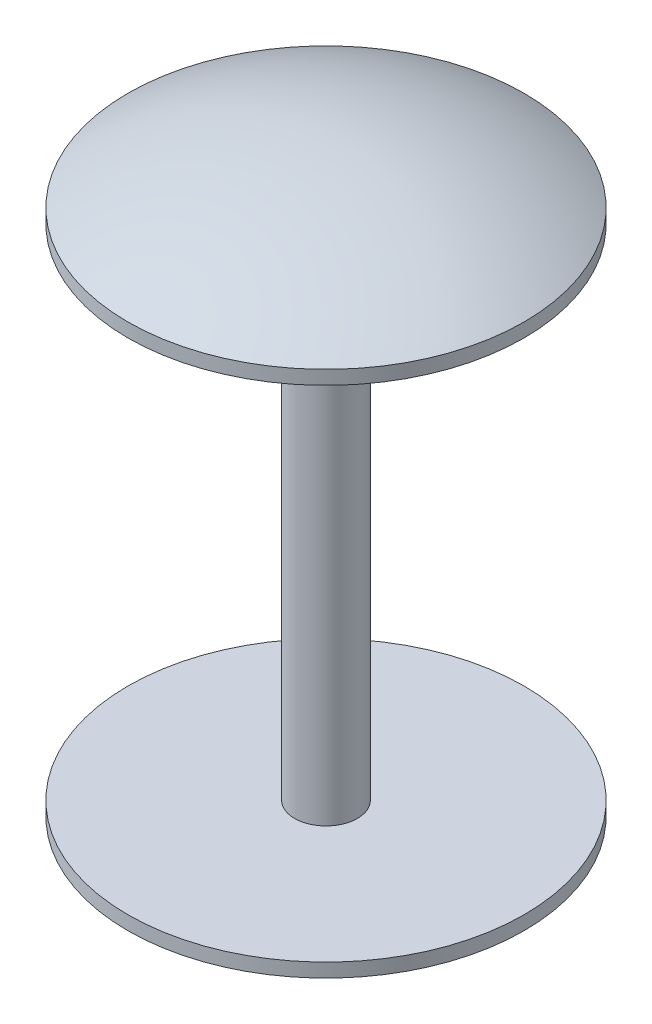
ISO-10303-21;
HEADER;
FILE_DESCRIPTION(('STEP AP214'),'2;1');
FILE_NAME('part.step','',(''),(''),'','','');
FILE_SCHEMA(('AUTOMOTIVE_DESIGN { 1 0 10303 214 1 1 1 1 }'));
ENDSEC;
DATA;
#1=APPLICATION_CONTEXT('core data for automotive mechanical design processes');
#2=APPLICATION_PROTOCOL_DEFINITION('international standard','automotive_design',2000,#1);
#3=PRODUCT_CONTEXT('',#1,'mechanical');
#4=PRODUCT('Part','Part','',(#3));
#5=PRODUCT_RELATED_PRODUCT_CATEGORY('part','',(#4));
#6=PRODUCT_DEFINITION_FORMATION('','',#4);
#7=PRODUCT_DEFINITION_CONTEXT('part definition',#1,'design');
#8=PRODUCT_DEFINITION('design','',#6,#7);
#9=PRODUCT_DEFINITION_SHAPE('','',#8);
#10=(LENGTH_UNIT() NAMED_UNIT(*) SI_UNIT(.MILLI.,.METRE.));
#11=(NAMED_UNIT(*) PLANE_ANGLE_UNIT() SI_UNIT($,.RADIAN.));
#12=(NAMED_UNIT(*) SI_UNIT($,.STERADIAN.) SOLID_ANGLE_UNIT());
#13=UNCERTAINTY_MEASURE_WITH_UNIT(LENGTH_MEASURE(1.E-05),#10,'distance_accuracy_value','');
#14=(GEOMETRIC_REPRESENTATION_CONTEXT(3) GLOBAL_UNCERTAINTY_ASSIGNED_CONTEXT((#13)) GLOBAL_UNIT_ASSIGNED_CONTEXT((#10,
#11,#12)) REPRESENTATION_CONTEXT('',''));
#15=CARTESIAN_POINT('',(0.,0.,0.));
#16=DIRECTION('',(0.,0.,1.));
#17=DIRECTION('',(1.,0.,0.));
#18=AXIS2_PLACEMENT_3D('',#15,#16,#17);
#19=CARTESIAN_POINT('',(0.,19.,0.));
#20=DIRECTION('',(0.,-1.,0.));
#21=DIRECTION('',(0.,0.,-1.));
#22=AXIS2_PLACEMENT_3D('',#19,#20,#21);
#23=CYLINDRICAL_SURFACE('',#22,14.2786773106514);
#24=CARTESIAN_POINT('',(0.,-19.,0.));
#25=DIRECTION('',(0.,1.,0.));
#26=DIRECTION('',(0.,0.,1.));
#27=AXIS2_PLACEMENT_3D('',#24,#25,#26);
#28=CIRCLE('',#27,14.2786773106514);
#29=CARTESIAN_POINT('',(0.,-19.,14.2786773106514));
#30=VERTEX_POINT('',#29);
#31=EDGE_CURVE('E42',#30,#30,#28,.T.);
#32=ORIENTED_EDGE('',*,*,#31,.T.);
#33=EDGE_LOOP('',(#32));
#34=FACE_BOUND('',#33,.T.);
#35=CARTESIAN_POINT('',(0.,-18.,0.));
#36=DIRECTION('',(0.,1.,0.));
#37=DIRECTION('',(0.,0.,1.));
#38=AXIS2_PLACEMENT_3D('',#35,#36,#37);
#39=CIRCLE('',#38,14.2786773106514);
#40=CARTESIAN_POINT('',(0.,-18.,14.2786773106514));
#41=VERTEX_POINT('',#40);
#42=EDGE_CURVE('E46',#41,#41,#39,.T.);
#43=ORIENTED_EDGE('',*,*,#42,.F.);
#44=EDGE_LOOP('',(#43));
#45=FACE_BOUND('',#44,.T.);
#46=ADVANCED_FACE('F35',(#34,#45),#23,.T.);
#47=CARTESIAN_POINT('',(0.,4.485078217714,0.));
#48=DIRECTION('',(0.,0.,1.));
#49=DIRECTION('',(1.,0.,0.));
#50=AXIS2_PLACEMENT_3D('',#47,#48,#49);
#51=SPHERICAL_SURFACE('',#50,27.485078217714);
#52=CARTESIAN_POINT('',(0.,4.485078217714,0.));
#53=DIRECTION('',(0.,1.,0.));
#54=DIRECTION('',(0.,0.,1.));
#55=AXIS2_PLACEMENT_3D('',#52,#53,#54);
#56=SPHERICAL_SURFACE('',#55,27.485078217714);
#57=ORIENTED_EDGE('',*,*,#31,.F.);
#58=EDGE_LOOP('',(#57));
#59=FACE_BOUND('',#58,.T.);
#60=ADVANCED_FACE('F73',(#59),#56,.T.);
#61=CARTESIAN_POINT('',(0.,-18.,0.));
#62=DIRECTION('',(0.,1.,0.));
#63=DIRECTION('',(0.,0.,1.));
#64=AXIS2_PLACEMENT_3D('',#61,#62,#63);
#65=CYLINDRICAL_SURFACE('',#64,2.26163251067104);
#66=CARTESIAN_POINT('',(0.,-18.,0.));
#67=DIRECTION('',(0.,1.,0.));
#68=DIRECTION('',(0.,0.,1.));
#69=AXIS2_PLACEMENT_3D('',#66,#67,#68);
#70=CIRCLE('',#69,2.26163251067104);
#71=CARTESIAN_POINT('',(0.,-18.,2.26163251067104));
#72=VERTEX_POINT('',#71);
#73=EDGE_CURVE('E50',#72,#72,#70,.T.);
#74=ORIENTED_EDGE('',*,*,#73,.T.);
#75=EDGE_LOOP('',(#74));
#76=FACE_BOUND('',#75,.T.);
#77=CARTESIAN_POINT('',(0.,18.,0.));
#78=DIRECTION('',(0.,1.,0.));
#79=DIRECTION('',(0.,0.,1.));
#80=AXIS2_PLACEMENT_3D('',#77,#78,#79);
#81=CIRCLE('',#80,2.26163251067104);
#82=CARTESIAN_POINT('',(0.,18.,2.26163251067104));
#83=VERTEX_POINT('',#82);
#84=EDGE_CURVE('E56',#83,#83,#81,.T.);
#85=ORIENTED_EDGE('',*,*,#84,.F.);
#86=EDGE_LOOP('',(#85));
#87=FACE_BOUND('',#86,.T.);
#88=ADVANCED_FACE('F62',(#76,#87),#65,.T.);
#89=CARTESIAN_POINT('',(0.,-18.,0.));
#90=DIRECTION('',(0.,1.,0.));
#91=DIRECTION('',(0.,0.,1.));
#92=AXIS2_PLACEMENT_3D('',#89,#90,#91);
#93=PLANE('',#92);
#94=ORIENTED_EDGE('',*,*,#73,.F.);
#95=EDGE_LOOP('',(#94));
#96=FACE_BOUND('',#95,.T.);
#97=ORIENTED_EDGE('',*,*,#42,.T.);
#98=EDGE_LOOP('',(#97));
#99=FACE_BOUND('',#98,.T.);
#100=ADVANCED_FACE('F65',(#96,#99),#93,.T.);
#101=CARTESIAN_POINT('',(0.,18.,0.));
#102=DIRECTION('',(0.,1.,0.));
#103=DIRECTION('',(0.,0.,1.));
#104=AXIS2_PLACEMENT_3D('',#101,#102,#103);
#105=PLANE('',#104);
#106=ORIENTED_EDGE('',*,*,#84,.T.);
#107=EDGE_LOOP('',(#106));
#108=FACE_BOUND('',#107,.T.);
#109=CARTESIAN_POINT('',(0.,18.,0.));
#110=DIRECTION('',(0.,1.,0.));
#111=DIRECTION('',(0.,0.,1.));
#112=AXIS2_PLACEMENT_3D('',#109,#110,#111);
#113=CIRCLE('',#112,14.2786773106514);
#114=CARTESIAN_POINT('',(0.,18.,14.2786773106514));
#115=VERTEX_POINT('',#114);
#116=EDGE_CURVE('E53',#115,#115,#113,.T.);
#117=ORIENTED_EDGE('',*,*,#116,.F.);
#118=EDGE_LOOP('',(#117));
#119=FACE_BOUND('',#118,.T.);
#120=ADVANCED_FACE('F68',(#108,#119),#105,.F.);
#121=CARTESIAN_POINT('',(0.,-4.485078217714,0.));
#122=DIRECTION('',(0.,0.,1.));
#123=DIRECTION('',(1.,0.,0.));
#124=AXIS2_PLACEMENT_3D('',#121,#122,#123);
#125=SPHERICAL_SURFACE('',#124,27.485078217714);
#126=CARTESIAN_POINT('',(0.,-4.485078217714,0.));
#127=DIRECTION('',(0.,1.,0.));
#128=DIRECTION('',(0.,0.,1.));
#129=AXIS2_PLACEMENT_3D('',#126,#127,#128);
#130=SPHERICAL_SURFACE('',#129,27.485078217714);
#131=CARTESIAN_POINT('',(0.,19.,0.));
#132=DIRECTION('',(0.,1.,0.));
#133=DIRECTION('',(0.,0.,1.));
#134=AXIS2_PLACEMENT_3D('',#131,#132,#133);
#135=CIRCLE('',#134,14.2786773106514);
#136=CARTESIAN_POINT('',(0.,19.,14.2786773106514));
#137=VERTEX_POINT('',#136);
#138=EDGE_CURVE('E10',#137,#137,#135,.T.);
#139=ORIENTED_EDGE('',*,*,#138,.T.);
#140=EDGE_LOOP('',(#139));
#141=FACE_BOUND('',#140,.T.);
#142=ADVANCED_FACE('F37',(#141),#130,.T.);
#143=ORIENTED_EDGE('',*,*,#116,.T.);
#144=EDGE_LOOP('',(#143));
#145=FACE_BOUND('',#144,.T.);
#146=ORIENTED_EDGE('',*,*,#138,.F.);
#147=EDGE_LOOP('',(#146));
#148=FACE_BOUND('',#147,.T.);
#149=ADVANCED_FACE('F75',(#145,#148),#23,.T.);
#150=CLOSED_SHELL('',(#46,#60,#88,#100,#120,#142,#149));
#151=MANIFOLD_SOLID_BREP('B2',#150);
#152=ADVANCED_BREP_SHAPE_REPRESENTATION('',(#18,#151),#14);
#153=SHAPE_DEFINITION_REPRESENTATION(#9,#152);
ENDSEC;
END-ISO-10303-21;
